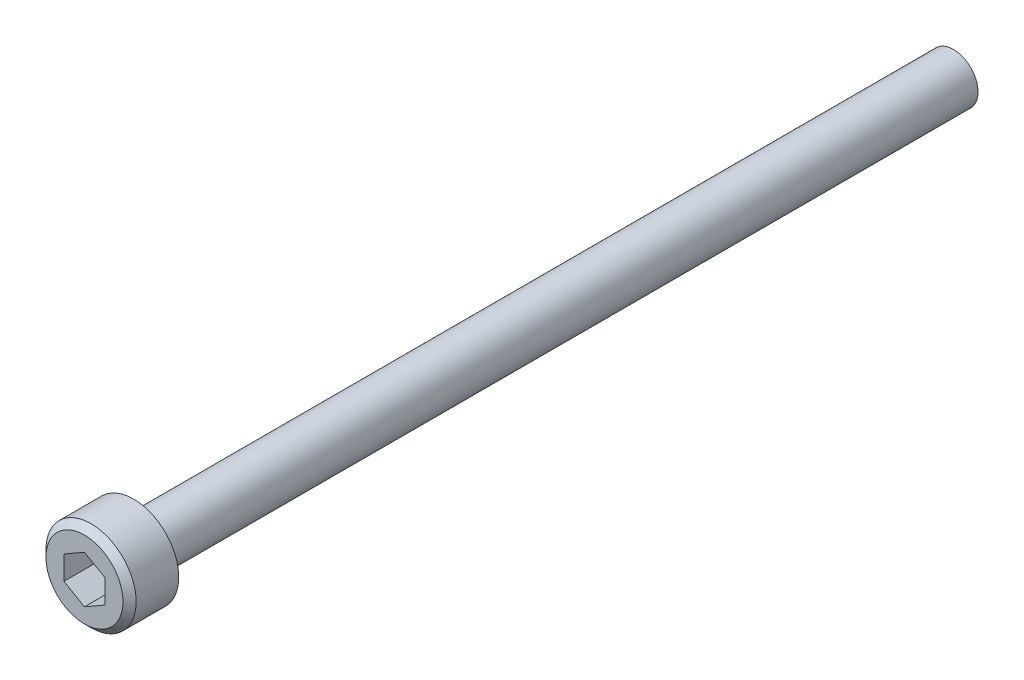
ISO-10303-21;
HEADER;
FILE_DESCRIPTION(('STEP AP214'),'2;1');
FILE_NAME('part.step','',(''),(''),'','','');
FILE_SCHEMA(('AUTOMOTIVE_DESIGN { 1 0 10303 214 1 1 1 1 }'));
ENDSEC;
DATA;
#1=APPLICATION_CONTEXT('core data for automotive mechanical design processes');
#2=APPLICATION_PROTOCOL_DEFINITION('international standard','automotive_design',2000,#1);
#3=PRODUCT_CONTEXT('',#1,'mechanical');
#4=PRODUCT('Part','Part','',(#3));
#5=PRODUCT_RELATED_PRODUCT_CATEGORY('part','',(#4));
#6=PRODUCT_DEFINITION_FORMATION('','',#4);
#7=PRODUCT_DEFINITION_CONTEXT('part definition',#1,'design');
#8=PRODUCT_DEFINITION('design','',#6,#7);
#9=PRODUCT_DEFINITION_SHAPE('','',#8);
#10=(LENGTH_UNIT() NAMED_UNIT(*) SI_UNIT(.MILLI.,.METRE.));
#11=(NAMED_UNIT(*) PLANE_ANGLE_UNIT() SI_UNIT($,.RADIAN.));
#12=(NAMED_UNIT(*) SI_UNIT($,.STERADIAN.) SOLID_ANGLE_UNIT());
#13=UNCERTAINTY_MEASURE_WITH_UNIT(LENGTH_MEASURE(1.E-05),#10,'distance_accuracy_value','');
#14=(GEOMETRIC_REPRESENTATION_CONTEXT(3) GLOBAL_UNCERTAINTY_ASSIGNED_CONTEXT((#13)) GLOBAL_UNIT_ASSIGNED_CONTEXT((#10,
#11,#12)) REPRESENTATION_CONTEXT('',''));
#15=CARTESIAN_POINT('',(0.,0.,0.));
#16=DIRECTION('',(0.,0.,1.));
#17=DIRECTION('',(1.,0.,0.));
#18=AXIS2_PLACEMENT_3D('',#15,#16,#17);
#19=CARTESIAN_POINT('',(2.75,0.,0.));
#20=DIRECTION('',(0.,0.,-1.));
#21=DIRECTION('',(-1.,0.,0.));
#22=AXIS2_PLACEMENT_3D('',#19,#20,#21);
#23=PLANE('',#22);
#24=CARTESIAN_POINT('',(0.,0.,0.));
#25=DIRECTION('',(0.,0.,-1.));
#26=DIRECTION('',(-1.,0.,0.));
#27=AXIS2_PLACEMENT_3D('',#24,#25,#26);
#28=CIRCLE('',#27,1.59999999991289);
#29=CARTESIAN_POINT('',(-1.59999999991289,0.,0.));
#30=VERTEX_POINT('',#29);
#31=EDGE_CURVE('E11',#30,#30,#28,.F.);
#32=ORIENTED_EDGE('',*,*,#31,.T.);
#33=EDGE_LOOP('',(#32));
#34=FACE_BOUND('',#33,.T.);
#35=CARTESIAN_POINT('',(0.,0.,0.));
#36=DIRECTION('',(0.,0.,1.));
#37=DIRECTION('',(1.,0.,0.));
#38=AXIS2_PLACEMENT_3D('',#35,#36,#37);
#39=CIRCLE('',#38,2.75);
#40=CARTESIAN_POINT('',(2.75,0.,0.));
#41=VERTEX_POINT('',#40);
#42=EDGE_CURVE('E144',#41,#41,#39,.T.);
#43=ORIENTED_EDGE('',*,*,#42,.F.);
#44=EDGE_LOOP('',(#43));
#45=FACE_BOUND('',#44,.T.);
#46=ADVANCED_FACE('F34',(#34,#45),#23,.T.);
#47=CARTESIAN_POINT('',(0.,0.,0.));
#48=DIRECTION('',(0.,0.,1.));
#49=DIRECTION('',(1.,0.,0.));
#50=AXIS2_PLACEMENT_3D('',#47,#48,#49);
#51=CYLINDRICAL_SURFACE('',#50,2.75);
#52=CARTESIAN_POINT('',(0.,0.,2.60000000033738));
#53=DIRECTION('',(0.,0.,1.));
#54=DIRECTION('',(1.,0.,0.));
#55=AXIS2_PLACEMENT_3D('',#52,#53,#54);
#56=CIRCLE('',#55,2.75);
#57=CARTESIAN_POINT('',(2.75,0.,2.60000000033738));
#58=VERTEX_POINT('',#57);
#59=EDGE_CURVE('E150',#58,#58,#56,.F.);
#60=ORIENTED_EDGE('',*,*,#59,.T.);
#61=EDGE_LOOP('',(#60));
#62=FACE_BOUND('',#61,.T.);
#63=ORIENTED_EDGE('',*,*,#42,.T.);
#64=EDGE_LOOP('',(#63));
#65=FACE_BOUND('',#64,.T.);
#66=ADVANCED_FACE('F167',(#62,#65),#51,.T.);
#67=CARTESIAN_POINT('',(0.,0.,3.));
#68=DIRECTION('',(0.,0.,1.));
#69=DIRECTION('',(1.,0.,0.));
#70=AXIS2_PLACEMENT_3D('',#67,#68,#69);
#71=PLANE('',#70);
#72=CARTESIAN_POINT('',(0.,0.,3.));
#73=DIRECTION('',(0.,0.,1.));
#74=DIRECTION('',(1.,0.,0.));
#75=AXIS2_PLACEMENT_3D('',#72,#73,#74);
#76=CIRCLE('',#75,2.34999999965527);
#77=CARTESIAN_POINT('',(2.34999999965527,0.,3.));
#78=VERTEX_POINT('',#77);
#79=EDGE_CURVE('E147',#78,#78,#76,.T.);
#80=ORIENTED_EDGE('',*,*,#79,.T.);
#81=EDGE_LOOP('',(#80));
#82=FACE_BOUND('',#81,.T.);
#83=DIRECTION('',(0.867051341244987,0.498218798968153,0.));
#84=VECTOR('',#83,1.);
#85=CARTESIAN_POINT('',(-0.00296690787608111,-1.44337262368073,3.));
#86=LINE('',#85,#84);
#87=CARTESIAN_POINT('',(-0.00296690787608111,-1.44337262368073,3.));
#88=VERTEX_POINT('',#87);
#89=CARTESIAN_POINT('',(1.24851390529647,-0.72425572943174,3.));
#90=VERTEX_POINT('',#89);
#91=EDGE_CURVE('E49',#88,#90,#86,.T.);
#92=ORIENTED_EDGE('',*,*,#91,.F.);
#93=DIRECTION('',(0.864995807171886,-0.501779088419452,0.));
#94=VECTOR('',#93,1.);
#95=CARTESIAN_POINT('',(-1.25148081317255,-0.719116894248988,3.));
#96=LINE('',#95,#94);
#97=CARTESIAN_POINT('',(-1.25148081317255,-0.719116894248988,3.));
#98=VERTEX_POINT('',#97);
#99=EDGE_CURVE('E132',#98,#88,#96,.T.);
#100=ORIENTED_EDGE('',*,*,#99,.F.);
#101=DIRECTION('',(-0.0020555340731005,-0.999997887387606,0.));
#102=VECTOR('',#101,1.);
#103=CARTESIAN_POINT('',(-1.24851390529646,0.724255729431739,3.));
#104=LINE('',#103,#102);
#105=CARTESIAN_POINT('',(-1.24851390529646,0.724255729431739,3.));
#106=VERTEX_POINT('',#105);
#107=EDGE_CURVE('E130',#106,#98,#104,.T.);
#108=ORIENTED_EDGE('',*,*,#107,.F.);
#109=DIRECTION('',(-0.867051341244987,-0.498218798968153,0.));
#110=VECTOR('',#109,1.);
#111=CARTESIAN_POINT('',(0.00296690787608388,1.44337262368073,3.));
#112=LINE('',#111,#110);
#113=CARTESIAN_POINT('',(0.00296690787608388,1.44337262368073,3.));
#114=VERTEX_POINT('',#113);
#115=EDGE_CURVE('E97',#114,#106,#112,.T.);
#116=ORIENTED_EDGE('',*,*,#115,.F.);
#117=DIRECTION('',(-0.864995807171887,0.501779088419452,0.));
#118=VECTOR('',#117,1.);
#119=CARTESIAN_POINT('',(1.25148081317255,0.719116894248987,3.));
#120=LINE('',#119,#118);
#121=CARTESIAN_POINT('',(1.25148081317255,0.719116894248987,3.));
#122=VERTEX_POINT('',#121);
#123=EDGE_CURVE('E126',#122,#114,#120,.T.);
#124=ORIENTED_EDGE('',*,*,#123,.F.);
#125=DIRECTION('',(0.00205553407310095,0.999997887387606,0.));
#126=VECTOR('',#125,1.);
#127=CARTESIAN_POINT('',(1.24851390529647,-0.72425572943174,3.));
#128=LINE('',#127,#126);
#129=EDGE_CURVE('E123',#90,#122,#128,.T.);
#130=ORIENTED_EDGE('',*,*,#129,.F.);
#131=EDGE_LOOP('',(#92,#100,#108,#116,#124,#130));
#132=FACE_BOUND('',#131,.T.);
#133=ADVANCED_FACE('F173',(#82,#132),#71,.T.);
#134=CARTESIAN_POINT('',(0.,0.,-50.));
#135=DIRECTION('',(0.,0.,1.));
#136=DIRECTION('',(1.,0.,0.));
#137=AXIS2_PLACEMENT_3D('',#134,#135,#136);
#138=CYLINDRICAL_SURFACE('',#137,1.5);
#139=CARTESIAN_POINT('',(0.,0.,-0.100000000083422));
#140=DIRECTION('',(0.,0.,-1.));
#141=DIRECTION('',(-1.,0.,0.));
#142=AXIS2_PLACEMENT_3D('',#139,#140,#141);
#143=CIRCLE('',#142,1.5);
#144=CARTESIAN_POINT('',(-1.5,0.,-0.100000000083422));
#145=VERTEX_POINT('',#144);
#146=EDGE_CURVE('E42',#145,#145,#143,.T.);
#147=ORIENTED_EDGE('',*,*,#146,.T.);
#148=EDGE_LOOP('',(#147));
#149=FACE_BOUND('',#148,.T.);
#150=CARTESIAN_POINT('',(0.,0.,-50.));
#151=DIRECTION('',(0.,0.,-1.));
#152=DIRECTION('',(-1.,0.,0.));
#153=AXIS2_PLACEMENT_3D('',#150,#151,#152);
#154=CIRCLE('',#153,1.5);
#155=CARTESIAN_POINT('',(-1.5,0.,-50.));
#156=VERTEX_POINT('',#155);
#157=EDGE_CURVE('E136',#156,#156,#154,.T.);
#158=ORIENTED_EDGE('',*,*,#157,.F.);
#159=EDGE_LOOP('',(#158));
#160=FACE_BOUND('',#159,.T.);
#161=ADVANCED_FACE('F155',(#149,#160),#138,.T.);
#162=CARTESIAN_POINT('',(0.,0.,-50.));
#163=DIRECTION('',(0.,0.,-1.));
#164=DIRECTION('',(-1.,0.,0.));
#165=AXIS2_PLACEMENT_3D('',#162,#163,#164);
#166=PLANE('',#165);
#167=ORIENTED_EDGE('',*,*,#157,.T.);
#168=EDGE_LOOP('',(#167));
#169=FACE_BOUND('',#168,.T.);
#170=ADVANCED_FACE('F183',(#169),#166,.T.);
#171=CARTESIAN_POINT('',(-0.00296690787608111,-1.44337262368073,0.5));
#172=DIRECTION('',(0.498218798968153,-0.867051341244987,0.));
#173=DIRECTION('',(0.867051341244987,0.498218798968153,0.));
#174=AXIS2_PLACEMENT_3D('',#171,#172,#173);
#175=PLANE('',#174);
#176=ORIENTED_EDGE('',*,*,#91,.T.);
#177=DIRECTION('',(0.,0.,1.));
#178=VECTOR('',#177,1.);
#179=CARTESIAN_POINT('',(1.24851390529647,-0.72425572943174,0.5));
#180=LINE('',#179,#178);
#181=CARTESIAN_POINT('',(1.24851390529647,-0.72425572943174,0.5));
#182=VERTEX_POINT('',#181);
#183=EDGE_CURVE('E79',#182,#90,#180,.T.);
#184=ORIENTED_EDGE('',*,*,#183,.F.);
#185=DIRECTION('',(0.867051341244987,0.498218798968153,0.));
#186=VECTOR('',#185,1.);
#187=CARTESIAN_POINT('',(-0.00296690787608111,-1.44337262368073,0.5));
#188=LINE('',#187,#186);
#189=CARTESIAN_POINT('',(-0.00296690787608111,-1.44337262368073,0.5));
#190=VERTEX_POINT('',#189);
#191=EDGE_CURVE('E134',#190,#182,#188,.T.);
#192=ORIENTED_EDGE('',*,*,#191,.F.);
#193=DIRECTION('',(0.,0.,1.));
#194=VECTOR('',#193,1.);
#195=CARTESIAN_POINT('',(-0.00296690787608111,-1.44337262368073,0.5));
#196=LINE('',#195,#194);
#197=EDGE_CURVE('E57',#190,#88,#196,.T.);
#198=ORIENTED_EDGE('',*,*,#197,.T.);
#199=EDGE_LOOP('',(#176,#184,#192,#198));
#200=FACE_BOUND('',#199,.T.);
#201=ADVANCED_FACE('F186',(#200),#175,.F.);
#202=CARTESIAN_POINT('',(-1.25148081317255,-0.719116894248988,0.5));
#203=DIRECTION('',(-0.501779088419452,-0.864995807171886,0.));
#204=DIRECTION('',(0.864995807171886,-0.501779088419452,0.));
#205=AXIS2_PLACEMENT_3D('',#202,#203,#204);
#206=PLANE('',#205);
#207=ORIENTED_EDGE('',*,*,#99,.T.);
#208=ORIENTED_EDGE('',*,*,#197,.F.);
#209=DIRECTION('',(0.864995807171886,-0.501779088419452,0.));
#210=VECTOR('',#209,1.);
#211=CARTESIAN_POINT('',(-1.25148081317255,-0.719116894248988,0.5));
#212=LINE('',#211,#210);
#213=CARTESIAN_POINT('',(-1.25148081317255,-0.719116894248988,0.5));
#214=VERTEX_POINT('',#213);
#215=EDGE_CURVE('E109',#214,#190,#212,.T.);
#216=ORIENTED_EDGE('',*,*,#215,.F.);
#217=DIRECTION('',(0.,0.,1.));
#218=VECTOR('',#217,1.);
#219=CARTESIAN_POINT('',(-1.25148081317255,-0.719116894248988,0.5));
#220=LINE('',#219,#218);
#221=EDGE_CURVE('E101',#214,#98,#220,.T.);
#222=ORIENTED_EDGE('',*,*,#221,.T.);
#223=EDGE_LOOP('',(#207,#208,#216,#222));
#224=FACE_BOUND('',#223,.T.);
#225=ADVANCED_FACE('F190',(#224),#206,.F.);
#226=CARTESIAN_POINT('',(-1.24851390529646,0.724255729431739,0.5));
#227=DIRECTION('',(-0.999997887387606,0.0020555340731005,0.));
#228=DIRECTION('',(-0.0020555340731005,-0.999997887387606,0.));
#229=AXIS2_PLACEMENT_3D('',#226,#227,#228);
#230=PLANE('',#229);
#231=ORIENTED_EDGE('',*,*,#107,.T.);
#232=ORIENTED_EDGE('',*,*,#221,.F.);
#233=DIRECTION('',(-0.0020555340731005,-0.999997887387606,0.));
#234=VECTOR('',#233,1.);
#235=CARTESIAN_POINT('',(-1.24851390529646,0.724255729431739,0.5));
#236=LINE('',#235,#234);
#237=CARTESIAN_POINT('',(-1.24851390529646,0.724255729431739,0.5));
#238=VERTEX_POINT('',#237);
#239=EDGE_CURVE('E105',#238,#214,#236,.T.);
#240=ORIENTED_EDGE('',*,*,#239,.F.);
#241=DIRECTION('',(0.,0.,1.));
#242=VECTOR('',#241,1.);
#243=CARTESIAN_POINT('',(-1.24851390529646,0.724255729431739,0.5));
#244=LINE('',#243,#242);
#245=EDGE_CURVE('E90',#238,#106,#244,.T.);
#246=ORIENTED_EDGE('',*,*,#245,.T.);
#247=EDGE_LOOP('',(#231,#232,#240,#246));
#248=FACE_BOUND('',#247,.T.);
#249=ADVANCED_FACE('F106',(#248),#230,.F.);
#250=CARTESIAN_POINT('',(0.00296690787608388,1.44337262368073,0.5));
#251=DIRECTION('',(-0.498218798968153,0.867051341244987,0.));
#252=DIRECTION('',(-0.867051341244987,-0.498218798968153,0.));
#253=AXIS2_PLACEMENT_3D('',#250,#251,#252);
#254=PLANE('',#253);
#255=ORIENTED_EDGE('',*,*,#115,.T.);
#256=ORIENTED_EDGE('',*,*,#245,.F.);
#257=DIRECTION('',(-0.867051341244987,-0.498218798968153,0.));
#258=VECTOR('',#257,1.);
#259=CARTESIAN_POINT('',(0.00296690787608388,1.44337262368073,0.5));
#260=LINE('',#259,#258);
#261=CARTESIAN_POINT('',(0.00296690787608388,1.44337262368073,0.5));
#262=VERTEX_POINT('',#261);
#263=EDGE_CURVE('E94',#262,#238,#260,.T.);
#264=ORIENTED_EDGE('',*,*,#263,.F.);
#265=DIRECTION('',(0.,0.,1.));
#266=VECTOR('',#265,1.);
#267=CARTESIAN_POINT('',(0.00296690787608388,1.44337262368073,0.5));
#268=LINE('',#267,#266);
#269=EDGE_CURVE('E102',#262,#114,#268,.T.);
#270=ORIENTED_EDGE('',*,*,#269,.T.);
#271=EDGE_LOOP('',(#255,#256,#264,#270));
#272=FACE_BOUND('',#271,.T.);
#273=ADVANCED_FACE('F92',(#272),#254,.F.);
#274=CARTESIAN_POINT('',(1.25148081317255,0.719116894248987,0.5));
#275=DIRECTION('',(0.501779088419452,0.864995807171886,0.));
#276=DIRECTION('',(-0.864995807171887,0.501779088419452,0.));
#277=AXIS2_PLACEMENT_3D('',#274,#275,#276);
#278=PLANE('',#277);
#279=ORIENTED_EDGE('',*,*,#123,.T.);
#280=ORIENTED_EDGE('',*,*,#269,.F.);
#281=DIRECTION('',(-0.864995807171887,0.501779088419452,0.));
#282=VECTOR('',#281,1.);
#283=CARTESIAN_POINT('',(1.25148081317255,0.719116894248987,0.5));
#284=LINE('',#283,#282);
#285=CARTESIAN_POINT('',(1.25148081317255,0.719116894248987,0.5));
#286=VERTEX_POINT('',#285);
#287=EDGE_CURVE('E115',#286,#262,#284,.T.);
#288=ORIENTED_EDGE('',*,*,#287,.F.);
#289=DIRECTION('',(0.,0.,1.));
#290=VECTOR('',#289,1.);
#291=CARTESIAN_POINT('',(1.25148081317255,0.719116894248987,0.5));
#292=LINE('',#291,#290);
#293=EDGE_CURVE('E139',#286,#122,#292,.T.);
#294=ORIENTED_EDGE('',*,*,#293,.T.);
#295=EDGE_LOOP('',(#279,#280,#288,#294));
#296=FACE_BOUND('',#295,.T.);
#297=ADVANCED_FACE('F194',(#296),#278,.F.);
#298=CARTESIAN_POINT('',(1.24851390529647,-0.72425572943174,0.5));
#299=DIRECTION('',(0.999997887387606,-0.00205553407310095,0.));
#300=DIRECTION('',(0.00205553407310095,0.999997887387606,0.));
#301=AXIS2_PLACEMENT_3D('',#298,#299,#300);
#302=PLANE('',#301);
#303=ORIENTED_EDGE('',*,*,#129,.T.);
#304=ORIENTED_EDGE('',*,*,#293,.F.);
#305=DIRECTION('',(0.00205553407310095,0.999997887387606,0.));
#306=VECTOR('',#305,1.);
#307=CARTESIAN_POINT('',(1.24851390529647,-0.72425572943174,0.5));
#308=LINE('',#307,#306);
#309=EDGE_CURVE('E117',#182,#286,#308,.T.);
#310=ORIENTED_EDGE('',*,*,#309,.F.);
#311=ORIENTED_EDGE('',*,*,#183,.T.);
#312=EDGE_LOOP('',(#303,#304,#310,#311));
#313=FACE_BOUND('',#312,.T.);
#314=ADVANCED_FACE('F191',(#313),#302,.F.);
#315=CARTESIAN_POINT('',(0.,0.,0.5));
#316=DIRECTION('',(0.,0.,1.));
#317=DIRECTION('',(1.,0.,0.));
#318=AXIS2_PLACEMENT_3D('',#315,#316,#317);
#319=PLANE('',#318);
#320=ORIENTED_EDGE('',*,*,#191,.T.);
#321=ORIENTED_EDGE('',*,*,#309,.T.);
#322=ORIENTED_EDGE('',*,*,#287,.T.);
#323=ORIENTED_EDGE('',*,*,#263,.T.);
#324=ORIENTED_EDGE('',*,*,#239,.T.);
#325=ORIENTED_EDGE('',*,*,#215,.T.);
#326=EDGE_LOOP('',(#320,#321,#322,#323,#324,#325));
#327=FACE_BOUND('',#326,.T.);
#328=ADVANCED_FACE('F112',(#327),#319,.T.);
#329=CARTESIAN_POINT('',(0.,0.,3.));
#330=DIRECTION('',(0.,0.,-1.));
#331=DIRECTION('',(-1.,0.,0.));
#332=AXIS2_PLACEMENT_3D('',#329,#330,#331);
#333=CONICAL_SURFACE('',#332,2.34999999965527,0.785398164250086);
#334=ORIENTED_EDGE('',*,*,#59,.F.);
#335=EDGE_LOOP('',(#334));
#336=FACE_BOUND('',#335,.T.);
#337=ORIENTED_EDGE('',*,*,#79,.F.);
#338=EDGE_LOOP('',(#337));
#339=FACE_BOUND('',#338,.T.);
#340=ADVANCED_FACE('F159',(#336,#339),#333,.T.);
#341=CARTESIAN_POINT('',(0.,0.,-0.100000000083422));
#342=DIRECTION('',(0.,0.,1.));
#343=DIRECTION('',(1.,0.,0.));
#344=AXIS2_PLACEMENT_3D('',#341,#342,#343);
#345=CONICAL_SURFACE('',#344,1.5,0.785398162544804);
#346=ORIENTED_EDGE('',*,*,#31,.F.);
#347=EDGE_LOOP('',(#346));
#348=FACE_BOUND('',#347,.T.);
#349=ORIENTED_EDGE('',*,*,#146,.F.);
#350=EDGE_LOOP('',(#349));
#351=FACE_BOUND('',#350,.T.);
#352=ADVANCED_FACE('F36',(#348,#351),#345,.T.);
#353=CLOSED_SHELL('',(#46,#66,#133,#161,#170,#201,#225,#249,#273,#297,#314,#328,#340,#352));
#354=MANIFOLD_SOLID_BREP('B2',#353);
#355=ADVANCED_BREP_SHAPE_REPRESENTATION('',(#18,#354),#14);
#356=SHAPE_DEFINITION_REPRESENTATION(#9,#355);
ENDSEC;
END-ISO-10303-21;
